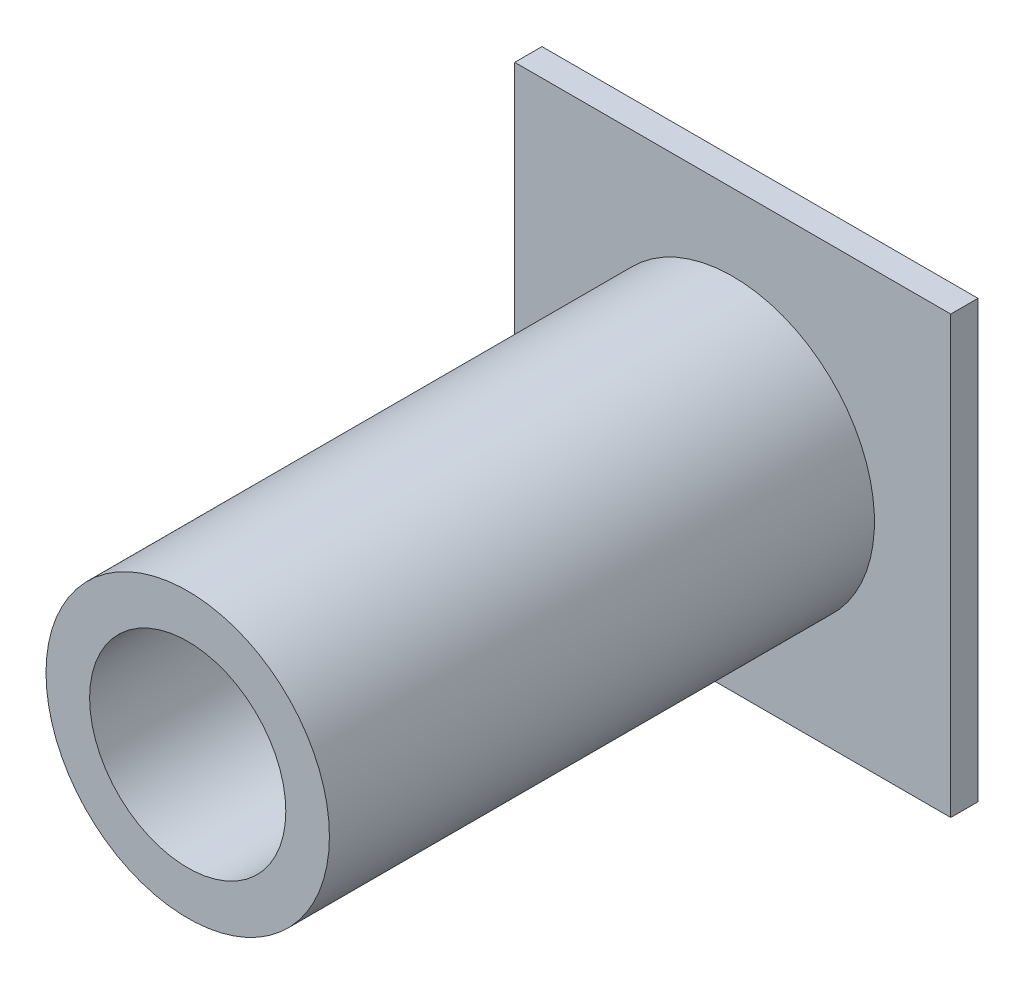
ISO-10303-21;
HEADER;
FILE_DESCRIPTION(('STEP AP214'),'2;1');
FILE_NAME('part.step','',(''),(''),'','','');
FILE_SCHEMA(('AUTOMOTIVE_DESIGN { 1 0 10303 214 1 1 1 1 }'));
ENDSEC;
DATA;
#1=APPLICATION_CONTEXT('core data for automotive mechanical design processes');
#2=APPLICATION_PROTOCOL_DEFINITION('international standard','automotive_design',2000,#1);
#3=PRODUCT_CONTEXT('',#1,'mechanical');
#4=PRODUCT('Part','Part','',(#3));
#5=PRODUCT_RELATED_PRODUCT_CATEGORY('part','',(#4));
#6=PRODUCT_DEFINITION_FORMATION('','',#4);
#7=PRODUCT_DEFINITION_CONTEXT('part definition',#1,'design');
#8=PRODUCT_DEFINITION('design','',#6,#7);
#9=PRODUCT_DEFINITION_SHAPE('','',#8);
#10=(LENGTH_UNIT() NAMED_UNIT(*) SI_UNIT(.MILLI.,.METRE.));
#11=(NAMED_UNIT(*) PLANE_ANGLE_UNIT() SI_UNIT($,.RADIAN.));
#12=(NAMED_UNIT(*) SI_UNIT($,.STERADIAN.) SOLID_ANGLE_UNIT());
#13=UNCERTAINTY_MEASURE_WITH_UNIT(LENGTH_MEASURE(1.E-05),#10,'distance_accuracy_value','');
#14=(GEOMETRIC_REPRESENTATION_CONTEXT(3) GLOBAL_UNCERTAINTY_ASSIGNED_CONTEXT((#13)) GLOBAL_UNIT_ASSIGNED_CONTEXT((#10,
#11,#12)) REPRESENTATION_CONTEXT('',''));
#15=CARTESIAN_POINT('',(0.,0.,0.));
#16=DIRECTION('',(0.,0.,1.));
#17=DIRECTION('',(1.,0.,0.));
#18=AXIS2_PLACEMENT_3D('',#15,#16,#17);
#19=CARTESIAN_POINT('',(0.,0.,0.5));
#20=DIRECTION('',(0.,0.,-1.));
#21=DIRECTION('',(-1.,0.,0.));
#22=AXIS2_PLACEMENT_3D('',#19,#20,#21);
#23=PLANE('',#22);
#24=DIRECTION('',(0.,1.,0.));
#25=VECTOR('',#24,1.);
#26=CARTESIAN_POINT('',(4.,3.99999999999999,0.5));
#27=LINE('',#26,#25);
#28=CARTESIAN_POINT('',(4.,-4.,0.5));
#29=VERTEX_POINT('',#28);
#30=CARTESIAN_POINT('',(4.,3.99999999999999,0.5));
#31=VERTEX_POINT('',#30);
#32=EDGE_CURVE('E86',#29,#31,#27,.T.);
#33=ORIENTED_EDGE('',*,*,#32,.T.);
#34=DIRECTION('',(-1.,0.,0.));
#35=VECTOR('',#34,1.);
#36=CARTESIAN_POINT('',(4.,3.99999999999999,0.5));
#37=LINE('',#36,#35);
#38=CARTESIAN_POINT('',(-4.,3.99999999999999,0.5));
#39=VERTEX_POINT('',#38);
#40=EDGE_CURVE('E81',#31,#39,#37,.T.);
#41=ORIENTED_EDGE('',*,*,#40,.T.);
#42=DIRECTION('',(0.,-1.,0.));
#43=VECTOR('',#42,1.);
#44=CARTESIAN_POINT('',(-4.,3.99999999999999,0.5));
#45=LINE('',#44,#43);
#46=CARTESIAN_POINT('',(-4.,-4.,0.5));
#47=VERTEX_POINT('',#46);
#48=EDGE_CURVE('E84',#39,#47,#45,.T.);
#49=ORIENTED_EDGE('',*,*,#48,.T.);
#50=DIRECTION('',(1.,0.,0.));
#51=VECTOR('',#50,1.);
#52=CARTESIAN_POINT('',(4.,-4.,0.5));
#53=LINE('',#52,#51);
#54=EDGE_CURVE('E50',#47,#29,#53,.T.);
#55=ORIENTED_EDGE('',*,*,#54,.T.);
#56=EDGE_LOOP('',(#33,#41,#49,#55));
#57=FACE_BOUND('',#56,.T.);
#58=CARTESIAN_POINT('',(0.,0.,0.5));
#59=DIRECTION('',(0.,0.,-1.));
#60=DIRECTION('',(-1.,0.,0.));
#61=AXIS2_PLACEMENT_3D('',#58,#59,#60);
#62=CIRCLE('',#61,2.6);
#63=CARTESIAN_POINT('',(-2.6,0.,0.5));
#64=VERTEX_POINT('',#63);
#65=EDGE_CURVE('E11',#64,#64,#62,.F.);
#66=ORIENTED_EDGE('',*,*,#65,.F.);
#67=EDGE_LOOP('',(#66));
#68=FACE_BOUND('',#67,.T.);
#69=ADVANCED_FACE('F33',(#57,#68),#23,.F.);
#70=CARTESIAN_POINT('',(4.,3.99999999999999,0.5));
#71=DIRECTION('',(-1.,0.,0.));
#72=DIRECTION('',(0.,0.,1.));
#73=AXIS2_PLACEMENT_3D('',#70,#71,#72);
#74=PLANE('',#73);
#75=DIRECTION('',(0.,1.,0.));
#76=VECTOR('',#75,1.);
#77=CARTESIAN_POINT('',(4.,3.99999999999999,0.));
#78=LINE('',#77,#76);
#79=CARTESIAN_POINT('',(4.,-4.,0.));
#80=VERTEX_POINT('',#79);
#81=CARTESIAN_POINT('',(4.,3.99999999999999,0.));
#82=VERTEX_POINT('',#81);
#83=EDGE_CURVE('E100',#80,#82,#78,.T.);
#84=ORIENTED_EDGE('',*,*,#83,.T.);
#85=DIRECTION('',(0.,0.,-1.));
#86=VECTOR('',#85,1.);
#87=CARTESIAN_POINT('',(4.,3.99999999999999,0.5));
#88=LINE('',#87,#86);
#89=EDGE_CURVE('E42',#31,#82,#88,.T.);
#90=ORIENTED_EDGE('',*,*,#89,.F.);
#91=ORIENTED_EDGE('',*,*,#32,.F.);
#92=DIRECTION('',(0.,0.,-1.));
#93=VECTOR('',#92,1.);
#94=CARTESIAN_POINT('',(4.,-4.,0.5));
#95=LINE('',#94,#93);
#96=EDGE_CURVE('E96',#29,#80,#95,.T.);
#97=ORIENTED_EDGE('',*,*,#96,.T.);
#98=EDGE_LOOP('',(#84,#90,#91,#97));
#99=FACE_BOUND('',#98,.T.);
#100=ADVANCED_FACE('F35',(#99),#74,.F.);
#101=CARTESIAN_POINT('',(4.,3.99999999999999,0.5));
#102=DIRECTION('',(0.,-1.,0.));
#103=DIRECTION('',(1.,0.,0.));
#104=AXIS2_PLACEMENT_3D('',#101,#102,#103);
#105=PLANE('',#104);
#106=DIRECTION('',(-1.,0.,0.));
#107=VECTOR('',#106,1.);
#108=CARTESIAN_POINT('',(4.,3.99999999999999,0.));
#109=LINE('',#108,#107);
#110=CARTESIAN_POINT('',(-4.,3.99999999999999,0.));
#111=VERTEX_POINT('',#110);
#112=EDGE_CURVE('E91',#82,#111,#109,.T.);
#113=ORIENTED_EDGE('',*,*,#112,.T.);
#114=DIRECTION('',(0.,0.,-1.));
#115=VECTOR('',#114,1.);
#116=CARTESIAN_POINT('',(-4.,3.99999999999999,0.5));
#117=LINE('',#116,#115);
#118=EDGE_CURVE('E89',#39,#111,#117,.T.);
#119=ORIENTED_EDGE('',*,*,#118,.F.);
#120=ORIENTED_EDGE('',*,*,#40,.F.);
#121=ORIENTED_EDGE('',*,*,#89,.T.);
#122=EDGE_LOOP('',(#113,#119,#120,#121));
#123=FACE_BOUND('',#122,.T.);
#124=ADVANCED_FACE('F90',(#123),#105,.F.);
#125=CARTESIAN_POINT('',(-4.,3.99999999999999,0.5));
#126=DIRECTION('',(1.,0.,0.));
#127=DIRECTION('',(0.,0.,-1.));
#128=AXIS2_PLACEMENT_3D('',#125,#126,#127);
#129=PLANE('',#128);
#130=DIRECTION('',(0.,-1.,0.));
#131=VECTOR('',#130,1.);
#132=CARTESIAN_POINT('',(-4.,3.99999999999999,0.));
#133=LINE('',#132,#131);
#134=CARTESIAN_POINT('',(-4.,-4.,0.));
#135=VERTEX_POINT('',#134);
#136=EDGE_CURVE('E67',#111,#135,#133,.T.);
#137=ORIENTED_EDGE('',*,*,#136,.T.);
#138=DIRECTION('',(0.,0.,-1.));
#139=VECTOR('',#138,1.);
#140=CARTESIAN_POINT('',(-4.,-4.,0.5));
#141=LINE('',#140,#139);
#142=EDGE_CURVE('E92',#47,#135,#141,.T.);
#143=ORIENTED_EDGE('',*,*,#142,.F.);
#144=ORIENTED_EDGE('',*,*,#48,.F.);
#145=ORIENTED_EDGE('',*,*,#118,.T.);
#146=EDGE_LOOP('',(#137,#143,#144,#145));
#147=FACE_BOUND('',#146,.T.);
#148=ADVANCED_FACE('F94',(#147),#129,.F.);
#149=CARTESIAN_POINT('',(4.,-4.,0.5));
#150=DIRECTION('',(0.,1.,0.));
#151=DIRECTION('',(-1.,0.,0.));
#152=AXIS2_PLACEMENT_3D('',#149,#150,#151);
#153=PLANE('',#152);
#154=DIRECTION('',(1.,0.,0.));
#155=VECTOR('',#154,1.);
#156=CARTESIAN_POINT('',(4.,-4.,0.));
#157=LINE('',#156,#155);
#158=EDGE_CURVE('E73',#135,#80,#157,.T.);
#159=ORIENTED_EDGE('',*,*,#158,.T.);
#160=ORIENTED_EDGE('',*,*,#96,.F.);
#161=ORIENTED_EDGE('',*,*,#54,.F.);
#162=ORIENTED_EDGE('',*,*,#142,.T.);
#163=EDGE_LOOP('',(#159,#160,#161,#162));
#164=FACE_BOUND('',#163,.T.);
#165=ADVANCED_FACE('F114',(#164),#153,.F.);
#166=CARTESIAN_POINT('',(0.,0.,0.));
#167=DIRECTION('',(0.,0.,-1.));
#168=DIRECTION('',(-1.,0.,0.));
#169=AXIS2_PLACEMENT_3D('',#166,#167,#168);
#170=PLANE('',#169);
#171=ORIENTED_EDGE('',*,*,#83,.F.);
#172=ORIENTED_EDGE('',*,*,#158,.F.);
#173=ORIENTED_EDGE('',*,*,#136,.F.);
#174=ORIENTED_EDGE('',*,*,#112,.F.);
#175=EDGE_LOOP('',(#171,#172,#173,#174));
#176=FACE_BOUND('',#175,.T.);
#177=ADVANCED_FACE('F111',(#176),#170,.T.);
#178=CARTESIAN_POINT('',(0.,0.,10.5));
#179=DIRECTION('',(0.,0.,-1.));
#180=DIRECTION('',(-1.,0.,0.));
#181=AXIS2_PLACEMENT_3D('',#178,#179,#180);
#182=CYLINDRICAL_SURFACE('',#181,2.6);
#183=CARTESIAN_POINT('',(0.,0.,10.5));
#184=DIRECTION('',(0.,0.,1.));
#185=DIRECTION('',(1.,0.,0.));
#186=AXIS2_PLACEMENT_3D('',#183,#184,#185);
#187=CIRCLE('',#186,2.6);
#188=CARTESIAN_POINT('',(2.6,0.,10.5));
#189=VERTEX_POINT('',#188);
#190=EDGE_CURVE('E103',#189,#189,#187,.T.);
#191=ORIENTED_EDGE('',*,*,#190,.F.);
#192=EDGE_LOOP('',(#191));
#193=FACE_BOUND('',#192,.T.);
#194=ORIENTED_EDGE('',*,*,#65,.T.);
#195=EDGE_LOOP('',(#194));
#196=FACE_BOUND('',#195,.T.);
#197=ADVANCED_FACE('F113',(#193,#196),#182,.T.);
#198=CARTESIAN_POINT('',(0.,0.,10.5));
#199=DIRECTION('',(0.,0.,1.));
#200=DIRECTION('',(1.,0.,0.));
#201=AXIS2_PLACEMENT_3D('',#198,#199,#200);
#202=PLANE('',#201);
#203=CARTESIAN_POINT('',(0.,0.,10.5));
#204=DIRECTION('',(0.,0.,1.));
#205=DIRECTION('',(1.,0.,0.));
#206=AXIS2_PLACEMENT_3D('',#203,#204,#205);
#207=CIRCLE('',#206,1.8);
#208=CARTESIAN_POINT('',(1.8,0.,10.5));
#209=VERTEX_POINT('',#208);
#210=EDGE_CURVE('E145',#209,#209,#207,.T.);
#211=ORIENTED_EDGE('',*,*,#210,.F.);
#212=EDGE_LOOP('',(#211));
#213=FACE_BOUND('',#212,.T.);
#214=ORIENTED_EDGE('',*,*,#190,.T.);
#215=EDGE_LOOP('',(#214));
#216=FACE_BOUND('',#215,.T.);
#217=ADVANCED_FACE('F120',(#213,#216),#202,.T.);
#218=CARTESIAN_POINT('',(0.,0.,0.5));
#219=DIRECTION('',(0.,0.,-1.));
#220=DIRECTION('',(-1.,0.,0.));
#221=AXIS2_PLACEMENT_3D('',#218,#219,#220);
#222=PLANE('',#221);
#223=CARTESIAN_POINT('',(0.,0.,0.5));
#224=DIRECTION('',(0.,0.,-1.));
#225=DIRECTION('',(-1.,0.,0.));
#226=AXIS2_PLACEMENT_3D('',#223,#224,#225);
#227=CIRCLE('',#226,1.8);
#228=CARTESIAN_POINT('',(-1.8,0.,0.5));
#229=VERTEX_POINT('',#228);
#230=EDGE_CURVE('E148',#229,#229,#227,.F.);
#231=ORIENTED_EDGE('',*,*,#230,.T.);
#232=EDGE_LOOP('',(#231));
#233=FACE_BOUND('',#232,.T.);
#234=ADVANCED_FACE('F132',(#233),#222,.F.);
#235=CARTESIAN_POINT('',(0.,0.,-4.59116882454314));
#236=DIRECTION('',(0.,0.,1.));
#237=DIRECTION('',(1.,0.,0.));
#238=AXIS2_PLACEMENT_3D('',#235,#236,#237);
#239=CYLINDRICAL_SURFACE('',#238,1.8);
#240=ORIENTED_EDGE('',*,*,#210,.T.);
#241=EDGE_LOOP('',(#240));
#242=FACE_BOUND('',#241,.T.);
#243=ORIENTED_EDGE('',*,*,#230,.F.);
#244=EDGE_LOOP('',(#243));
#245=FACE_BOUND('',#244,.T.);
#246=ADVANCED_FACE('F136',(#242,#245),#239,.F.);
#247=CLOSED_SHELL('',(#69,#100,#124,#148,#165,#177,#197,#217,#234,#246));
#248=MANIFOLD_SOLID_BREP('B2',#247);
#249=ADVANCED_BREP_SHAPE_REPRESENTATION('',(#18,#248),#14);
#250=SHAPE_DEFINITION_REPRESENTATION(#9,#249);
ENDSEC;
END-ISO-10303-21;
